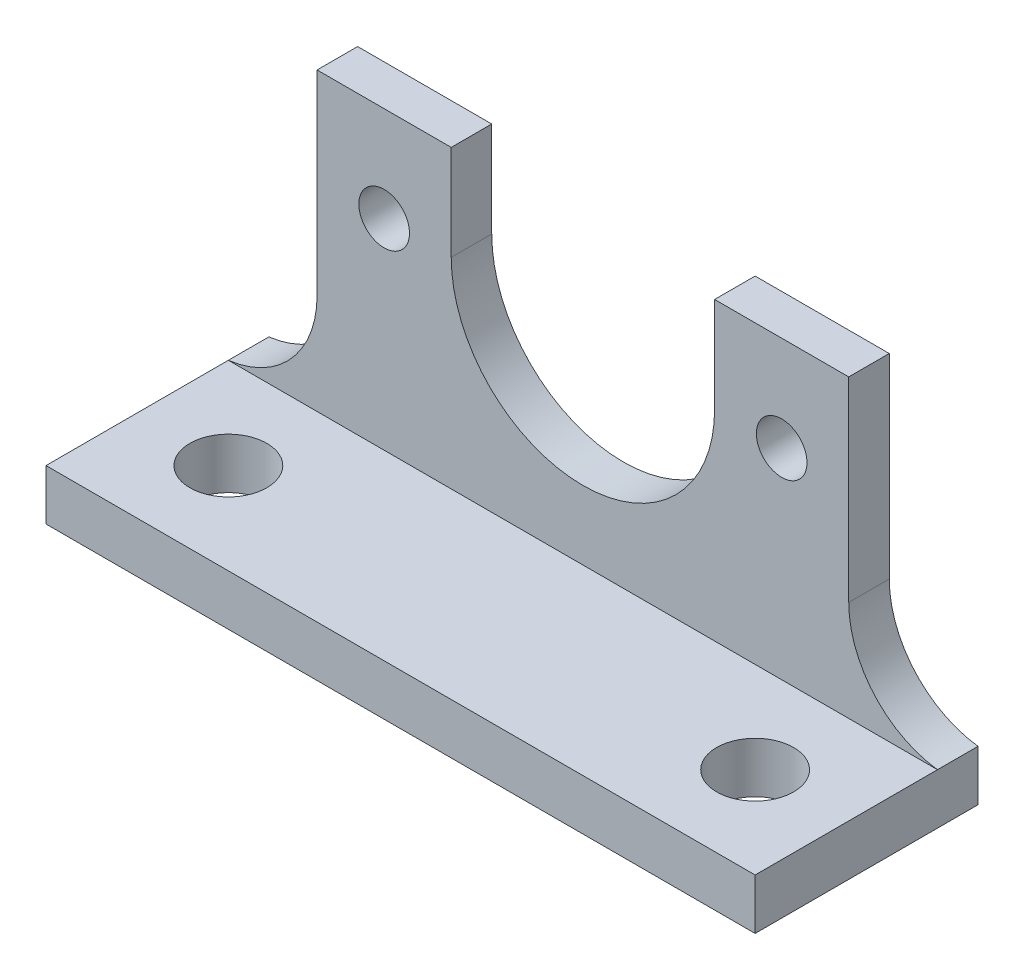
ISO-10303-21;
HEADER;
FILE_DESCRIPTION(('STEP AP214'),'2;1');
FILE_NAME('part.step','',(''),(''),'','','');
FILE_SCHEMA(('AUTOMOTIVE_DESIGN { 1 0 10303 214 1 1 1 1 }'));
ENDSEC;
DATA;
#1=APPLICATION_CONTEXT('core data for automotive mechanical design processes');
#2=APPLICATION_PROTOCOL_DEFINITION('international standard','automotive_design',2000,#1);
#3=PRODUCT_CONTEXT('',#1,'mechanical');
#4=PRODUCT('Part','Part','',(#3));
#5=PRODUCT_RELATED_PRODUCT_CATEGORY('part','',(#4));
#6=PRODUCT_DEFINITION_FORMATION('','',#4);
#7=PRODUCT_DEFINITION_CONTEXT('part definition',#1,'design');
#8=PRODUCT_DEFINITION('design','',#6,#7);
#9=PRODUCT_DEFINITION_SHAPE('','',#8);
#10=(LENGTH_UNIT() NAMED_UNIT(*) SI_UNIT(.MILLI.,.METRE.));
#11=(NAMED_UNIT(*) PLANE_ANGLE_UNIT() SI_UNIT($,.RADIAN.));
#12=(NAMED_UNIT(*) SI_UNIT($,.STERADIAN.) SOLID_ANGLE_UNIT());
#13=UNCERTAINTY_MEASURE_WITH_UNIT(LENGTH_MEASURE(1.E-05),#10,'distance_accuracy_value','');
#14=(GEOMETRIC_REPRESENTATION_CONTEXT(3) GLOBAL_UNCERTAINTY_ASSIGNED_CONTEXT((#13)) GLOBAL_UNIT_ASSIGNED_CONTEXT((#10,
#11,#12)) REPRESENTATION_CONTEXT('',''));
#15=CARTESIAN_POINT('',(0.,0.,0.));
#16=DIRECTION('',(0.,0.,1.));
#17=DIRECTION('',(1.,0.,0.));
#18=AXIS2_PLACEMENT_3D('',#15,#16,#17);
#19=CARTESIAN_POINT('',(0.,-5.23076923076924,2.54));
#20=DIRECTION('',(0.,0.,1.));
#21=DIRECTION('',(1.,0.,0.));
#22=AXIS2_PLACEMENT_3D('',#19,#20,#21);
#23=PLANE('',#22);
#24=DIRECTION('',(-1.,0.,0.));
#25=VECTOR('',#24,1.);
#26=CARTESIAN_POINT('',(0.,-17.8037692307692,2.54));
#27=LINE('',#26,#25);
#28=CARTESIAN_POINT('',(22.225,-17.8037692307692,2.54));
#29=VERTEX_POINT('',#28);
#30=CARTESIAN_POINT('',(-22.225,-17.8037692307692,2.54));
#31=VERTEX_POINT('',#30);
#32=EDGE_CURVE('E262',#29,#31,#27,.T.);
#33=ORIENTED_EDGE('',*,*,#32,.F.);
#34=CARTESIAN_POINT('',(23.0124,-11.502777146978,2.54));
#35=DIRECTION('',(0.,0.,1.));
#36=DIRECTION('',(1.,0.,0.));
#37=AXIS2_PLACEMENT_3D('',#34,#35,#36);
#38=CIRCLE('',#37,6.35);
#39=CARTESIAN_POINT('',(16.6624,-11.502777146978,2.54));
#40=VERTEX_POINT('',#39);
#41=EDGE_CURVE('E12',#29,#40,#38,.F.);
#42=ORIENTED_EDGE('',*,*,#41,.T.);
#43=DIRECTION('',(0.,1.,0.));
#44=VECTOR('',#43,1.);
#45=CARTESIAN_POINT('',(16.6624,-5.23076923076924,2.54));
#46=LINE('',#45,#44);
#47=CARTESIAN_POINT('',(16.6624,0.738461538461539,2.54));
#48=VERTEX_POINT('',#47);
#49=EDGE_CURVE('E241',#40,#48,#46,.T.);
#50=ORIENTED_EDGE('',*,*,#49,.T.);
#51=DIRECTION('',(-1.,0.,0.));
#52=VECTOR('',#51,1.);
#53=CARTESIAN_POINT('',(8.255,0.738461538461539,2.54));
#54=LINE('',#53,#52);
#55=CARTESIAN_POINT('',(8.255,0.738461538461539,2.54));
#56=VERTEX_POINT('',#55);
#57=EDGE_CURVE('E239',#48,#56,#54,.T.);
#58=ORIENTED_EDGE('',*,*,#57,.T.);
#59=DIRECTION('',(0.,-1.,0.));
#60=VECTOR('',#59,1.);
#61=CARTESIAN_POINT('',(8.255,-5.23076923076924,2.54));
#62=LINE('',#61,#60);
#63=CARTESIAN_POINT('',(8.255,-5.23076923076924,2.54));
#64=VERTEX_POINT('',#63);
#65=EDGE_CURVE('E216',#56,#64,#62,.T.);
#66=ORIENTED_EDGE('',*,*,#65,.T.);
#67=CARTESIAN_POINT('',(0.,-5.23076923076924,2.54));
#68=DIRECTION('',(0.,0.,-1.));
#69=DIRECTION('',(1.,0.,0.));
#70=AXIS2_PLACEMENT_3D('',#67,#68,#69);
#71=CIRCLE('',#70,8.255);
#72=CARTESIAN_POINT('',(-8.255,-5.23076923076924,2.54));
#73=VERTEX_POINT('',#72);
#74=EDGE_CURVE('E219',#64,#73,#71,.T.);
#75=ORIENTED_EDGE('',*,*,#74,.T.);
#76=DIRECTION('',(0.,1.,0.));
#77=VECTOR('',#76,1.);
#78=CARTESIAN_POINT('',(-8.255,-5.23076923076924,2.54));
#79=LINE('',#78,#77);
#80=CARTESIAN_POINT('',(-8.255,0.738461538461539,2.54));
#81=VERTEX_POINT('',#80);
#82=EDGE_CURVE('E249',#73,#81,#79,.T.);
#83=ORIENTED_EDGE('',*,*,#82,.T.);
#84=DIRECTION('',(-1.,0.,0.));
#85=VECTOR('',#84,1.);
#86=CARTESIAN_POINT('',(-8.255,0.738461538461539,2.54));
#87=LINE('',#86,#85);
#88=CARTESIAN_POINT('',(-16.6624,0.738461538461539,2.54));
#89=VERTEX_POINT('',#88);
#90=EDGE_CURVE('E247',#81,#89,#87,.T.);
#91=ORIENTED_EDGE('',*,*,#90,.T.);
#92=DIRECTION('',(0.,-1.,0.));
#93=VECTOR('',#92,1.);
#94=CARTESIAN_POINT('',(-16.6624,-5.23076923076924,2.54));
#95=LINE('',#94,#93);
#96=CARTESIAN_POINT('',(-16.6624,-11.502777146978,2.54));
#97=VERTEX_POINT('',#96);
#98=EDGE_CURVE('E243',#89,#97,#95,.T.);
#99=ORIENTED_EDGE('',*,*,#98,.T.);
#100=CARTESIAN_POINT('',(-23.0124,-11.502777146978,2.54));
#101=DIRECTION('',(0.,0.,1.));
#102=DIRECTION('',(1.,0.,0.));
#103=AXIS2_PLACEMENT_3D('',#100,#101,#102);
#104=CIRCLE('',#103,6.35);
#105=EDGE_CURVE('E189',#97,#31,#104,.F.);
#106=ORIENTED_EDGE('',*,*,#105,.T.);
#107=EDGE_LOOP('',(#33,#42,#50,#58,#66,#75,#83,#91,#99,#106));
#108=FACE_BOUND('',#107,.T.);
#109=CARTESIAN_POINT('',(-12.4587,-5.23076923076924,2.54));
#110=DIRECTION('',(0.,0.,1.));
#111=DIRECTION('',(1.,0.,0.));
#112=AXIS2_PLACEMENT_3D('',#109,#110,#111);
#113=CIRCLE('',#112,1.5875);
#114=CARTESIAN_POINT('',(-10.8712,-5.23076923076924,2.54));
#115=VERTEX_POINT('',#114);
#116=EDGE_CURVE('E237',#115,#115,#113,.T.);
#117=ORIENTED_EDGE('',*,*,#116,.F.);
#118=EDGE_LOOP('',(#117));
#119=FACE_BOUND('',#118,.T.);
#120=CARTESIAN_POINT('',(12.4587,-5.23076923076924,2.54));
#121=DIRECTION('',(0.,0.,1.));
#122=DIRECTION('',(-1.,0.,0.));
#123=AXIS2_PLACEMENT_3D('',#120,#121,#122);
#124=CIRCLE('',#123,1.5875);
#125=CARTESIAN_POINT('',(10.8712,-5.23076923076924,2.54));
#126=VERTEX_POINT('',#125);
#127=EDGE_CURVE('E256',#126,#126,#124,.T.);
#128=ORIENTED_EDGE('',*,*,#127,.F.);
#129=EDGE_LOOP('',(#128));
#130=FACE_BOUND('',#129,.T.);
#131=ADVANCED_FACE('F46',(#108,#119,#130),#23,.T.);
#132=CARTESIAN_POINT('',(0.,-5.23076923076924,0.));
#133=DIRECTION('',(0.,0.,1.));
#134=DIRECTION('',(1.,0.,0.));
#135=AXIS2_PLACEMENT_3D('',#132,#133,#134);
#136=PLANE('',#135);
#137=CARTESIAN_POINT('',(-12.4587,-5.23076923076924,0.));
#138=DIRECTION('',(0.,0.,1.));
#139=DIRECTION('',(1.,0.,0.));
#140=AXIS2_PLACEMENT_3D('',#137,#138,#139);
#141=CIRCLE('',#140,1.5875);
#142=CARTESIAN_POINT('',(-10.8712,-5.23076923076924,0.));
#143=VERTEX_POINT('',#142);
#144=EDGE_CURVE('E253',#143,#143,#141,.T.);
#145=ORIENTED_EDGE('',*,*,#144,.T.);
#146=EDGE_LOOP('',(#145));
#147=FACE_BOUND('',#146,.T.);
#148=DIRECTION('',(0.,1.,0.));
#149=VECTOR('',#148,1.);
#150=CARTESIAN_POINT('',(16.6624,-5.23076923076924,0.));
#151=LINE('',#150,#149);
#152=CARTESIAN_POINT('',(16.6624,-11.502777146978,0.));
#153=VERTEX_POINT('',#152);
#154=CARTESIAN_POINT('',(16.6624,0.738461538461539,0.));
#155=VERTEX_POINT('',#154);
#156=EDGE_CURVE('E222',#153,#155,#151,.T.);
#157=ORIENTED_EDGE('',*,*,#156,.F.);
#158=CARTESIAN_POINT('',(23.0124,-11.502777146978,0.));
#159=DIRECTION('',(0.,0.,1.));
#160=DIRECTION('',(1.,0.,0.));
#161=AXIS2_PLACEMENT_3D('',#158,#159,#160);
#162=CIRCLE('',#161,6.35);
#163=CARTESIAN_POINT('',(22.225,-17.8037692307692,0.));
#164=VERTEX_POINT('',#163);
#165=EDGE_CURVE('E54',#153,#164,#162,.T.);
#166=ORIENTED_EDGE('',*,*,#165,.T.);
#167=DIRECTION('',(0.,1.,0.));
#168=VECTOR('',#167,1.);
#169=CARTESIAN_POINT('',(22.225,-20.9787692307692,0.));
#170=LINE('',#169,#168);
#171=CARTESIAN_POINT('',(22.225,-20.9787692307692,0.));
#172=VERTEX_POINT('',#171);
#173=EDGE_CURVE('E150',#172,#164,#170,.T.);
#174=ORIENTED_EDGE('',*,*,#173,.F.);
#175=DIRECTION('',(1.,0.,0.));
#176=VECTOR('',#175,1.);
#177=CARTESIAN_POINT('',(-16.6624,-20.9787692307692,0.));
#178=LINE('',#177,#176);
#179=CARTESIAN_POINT('',(-22.225,-20.9787692307692,0.));
#180=VERTEX_POINT('',#179);
#181=EDGE_CURVE('E224',#180,#172,#178,.T.);
#182=ORIENTED_EDGE('',*,*,#181,.F.);
#183=DIRECTION('',(0.,-1.,0.));
#184=VECTOR('',#183,1.);
#185=CARTESIAN_POINT('',(-22.225,-20.9787692307692,0.));
#186=LINE('',#185,#184);
#187=CARTESIAN_POINT('',(-22.225,-17.8037692307692,0.));
#188=VERTEX_POINT('',#187);
#189=EDGE_CURVE('E147',#188,#180,#186,.T.);
#190=ORIENTED_EDGE('',*,*,#189,.F.);
#191=CARTESIAN_POINT('',(-23.0124,-11.502777146978,0.));
#192=DIRECTION('',(0.,0.,1.));
#193=DIRECTION('',(1.,0.,0.));
#194=AXIS2_PLACEMENT_3D('',#191,#192,#193);
#195=CIRCLE('',#194,6.35);
#196=CARTESIAN_POINT('',(-16.6624,-11.502777146978,0.));
#197=VERTEX_POINT('',#196);
#198=EDGE_CURVE('E187',#188,#197,#195,.T.);
#199=ORIENTED_EDGE('',*,*,#198,.T.);
#200=DIRECTION('',(0.,-1.,0.));
#201=VECTOR('',#200,1.);
#202=CARTESIAN_POINT('',(-16.6624,-5.23076923076924,0.));
#203=LINE('',#202,#201);
#204=CARTESIAN_POINT('',(-16.6624,0.738461538461539,0.));
#205=VERTEX_POINT('',#204);
#206=EDGE_CURVE('E226',#205,#197,#203,.T.);
#207=ORIENTED_EDGE('',*,*,#206,.F.);
#208=DIRECTION('',(-1.,0.,0.));
#209=VECTOR('',#208,1.);
#210=CARTESIAN_POINT('',(-8.255,0.738461538461539,0.));
#211=LINE('',#210,#209);
#212=CARTESIAN_POINT('',(-8.255,0.738461538461539,0.));
#213=VERTEX_POINT('',#212);
#214=EDGE_CURVE('E229',#213,#205,#211,.T.);
#215=ORIENTED_EDGE('',*,*,#214,.F.);
#216=DIRECTION('',(0.,1.,0.));
#217=VECTOR('',#216,1.);
#218=CARTESIAN_POINT('',(-8.255,-5.23076923076924,0.));
#219=LINE('',#218,#217);
#220=CARTESIAN_POINT('',(-8.255,-5.23076923076924,0.));
#221=VERTEX_POINT('',#220);
#222=EDGE_CURVE('E232',#221,#213,#219,.T.);
#223=ORIENTED_EDGE('',*,*,#222,.F.);
#224=CARTESIAN_POINT('',(0.,-5.23076923076924,0.));
#225=DIRECTION('',(0.,0.,-1.));
#226=DIRECTION('',(1.,0.,0.));
#227=AXIS2_PLACEMENT_3D('',#224,#225,#226);
#228=CIRCLE('',#227,8.255);
#229=CARTESIAN_POINT('',(8.255,-5.23076923076924,0.));
#230=VERTEX_POINT('',#229);
#231=EDGE_CURVE('E234',#230,#221,#228,.T.);
#232=ORIENTED_EDGE('',*,*,#231,.F.);
#233=DIRECTION('',(0.,-1.,0.));
#234=VECTOR('',#233,1.);
#235=CARTESIAN_POINT('',(8.255,-5.23076923076924,0.));
#236=LINE('',#235,#234);
#237=CARTESIAN_POINT('',(8.255,0.738461538461539,0.));
#238=VERTEX_POINT('',#237);
#239=EDGE_CURVE('E217',#238,#230,#236,.T.);
#240=ORIENTED_EDGE('',*,*,#239,.F.);
#241=DIRECTION('',(-1.,0.,0.));
#242=VECTOR('',#241,1.);
#243=CARTESIAN_POINT('',(8.255,0.738461538461539,0.));
#244=LINE('',#243,#242);
#245=EDGE_CURVE('E220',#155,#238,#244,.T.);
#246=ORIENTED_EDGE('',*,*,#245,.F.);
#247=EDGE_LOOP('',(#157,#166,#174,#182,#190,#199,#207,#215,#223,#232,#240,#246));
#248=FACE_BOUND('',#247,.T.);
#249=CARTESIAN_POINT('',(12.4587,-5.23076923076924,0.));
#250=DIRECTION('',(0.,0.,1.));
#251=DIRECTION('',(-1.,0.,0.));
#252=AXIS2_PLACEMENT_3D('',#249,#250,#251);
#253=CIRCLE('',#252,1.5875);
#254=CARTESIAN_POINT('',(10.8712,-5.23076923076924,0.));
#255=VERTEX_POINT('',#254);
#256=EDGE_CURVE('E259',#255,#255,#253,.T.);
#257=ORIENTED_EDGE('',*,*,#256,.T.);
#258=EDGE_LOOP('',(#257));
#259=FACE_BOUND('',#258,.T.);
#260=ADVANCED_FACE('F313',(#147,#248,#259),#136,.F.);
#261=CARTESIAN_POINT('',(0.,-5.23076923076924,2.54));
#262=DIRECTION('',(0.,0.,-1.));
#263=DIRECTION('',(-1.,0.,0.));
#264=AXIS2_PLACEMENT_3D('',#261,#262,#263);
#265=CYLINDRICAL_SURFACE('',#264,8.255);
#266=ORIENTED_EDGE('',*,*,#231,.T.);
#267=DIRECTION('',(0.,0.,-1.));
#268=VECTOR('',#267,1.);
#269=CARTESIAN_POINT('',(-8.255,-5.23076923076924,2.54));
#270=LINE('',#269,#268);
#271=EDGE_CURVE('E198',#73,#221,#270,.T.);
#272=ORIENTED_EDGE('',*,*,#271,.F.);
#273=ORIENTED_EDGE('',*,*,#74,.F.);
#274=DIRECTION('',(0.,0.,-1.));
#275=VECTOR('',#274,1.);
#276=CARTESIAN_POINT('',(8.255,-5.23076923076924,2.54));
#277=LINE('',#276,#275);
#278=EDGE_CURVE('E213',#64,#230,#277,.T.);
#279=ORIENTED_EDGE('',*,*,#278,.T.);
#280=EDGE_LOOP('',(#266,#272,#273,#279));
#281=FACE_BOUND('',#280,.T.);
#282=ADVANCED_FACE('F330',(#281),#265,.F.);
#283=CARTESIAN_POINT('',(-8.255,-5.23076923076924,2.54));
#284=DIRECTION('',(-1.,0.,0.));
#285=DIRECTION('',(0.,0.,1.));
#286=AXIS2_PLACEMENT_3D('',#283,#284,#285);
#287=PLANE('',#286);
#288=ORIENTED_EDGE('',*,*,#222,.T.);
#289=DIRECTION('',(0.,0.,-1.));
#290=VECTOR('',#289,1.);
#291=CARTESIAN_POINT('',(-8.255,0.738461538461539,2.54));
#292=LINE('',#291,#290);
#293=EDGE_CURVE('E201',#81,#213,#292,.T.);
#294=ORIENTED_EDGE('',*,*,#293,.F.);
#295=ORIENTED_EDGE('',*,*,#82,.F.);
#296=ORIENTED_EDGE('',*,*,#271,.T.);
#297=EDGE_LOOP('',(#288,#294,#295,#296));
#298=FACE_BOUND('',#297,.T.);
#299=ADVANCED_FACE('F327',(#298),#287,.F.);
#300=CARTESIAN_POINT('',(-8.255,0.738461538461539,2.54));
#301=DIRECTION('',(0.,-1.,0.));
#302=DIRECTION('',(0.,0.,-1.));
#303=AXIS2_PLACEMENT_3D('',#300,#301,#302);
#304=PLANE('',#303);
#305=ORIENTED_EDGE('',*,*,#214,.T.);
#306=DIRECTION('',(0.,0.,-1.));
#307=VECTOR('',#306,1.);
#308=CARTESIAN_POINT('',(-16.6624,0.738461538461539,2.54));
#309=LINE('',#308,#307);
#310=EDGE_CURVE('E204',#89,#205,#309,.T.);
#311=ORIENTED_EDGE('',*,*,#310,.F.);
#312=ORIENTED_EDGE('',*,*,#90,.F.);
#313=ORIENTED_EDGE('',*,*,#293,.T.);
#314=EDGE_LOOP('',(#305,#311,#312,#313));
#315=FACE_BOUND('',#314,.T.);
#316=ADVANCED_FACE('F321',(#315),#304,.F.);
#317=CARTESIAN_POINT('',(-16.6624,-5.23076923076924,2.54));
#318=DIRECTION('',(1.,0.,0.));
#319=DIRECTION('',(0.,1.,0.));
#320=AXIS2_PLACEMENT_3D('',#317,#318,#319);
#321=PLANE('',#320);
#322=ORIENTED_EDGE('',*,*,#206,.T.);
#323=DIRECTION('',(0.,0.,1.));
#324=VECTOR('',#323,1.);
#325=CARTESIAN_POINT('',(-16.6624,-11.502777146978,2.54));
#326=LINE('',#325,#324);
#327=EDGE_CURVE('E195',#197,#97,#326,.T.);
#328=ORIENTED_EDGE('',*,*,#327,.T.);
#329=ORIENTED_EDGE('',*,*,#98,.F.);
#330=ORIENTED_EDGE('',*,*,#310,.T.);
#331=EDGE_LOOP('',(#322,#328,#329,#330));
#332=FACE_BOUND('',#331,.T.);
#333=ADVANCED_FACE('F317',(#332),#321,.F.);
#334=CARTESIAN_POINT('',(-16.6624,-20.9787692307692,2.54));
#335=DIRECTION('',(0.,1.,0.));
#336=DIRECTION('',(0.,0.,1.));
#337=AXIS2_PLACEMENT_3D('',#334,#335,#336);
#338=PLANE('',#337);
#339=CARTESIAN_POINT('',(16.51,-20.9787692307692,8.255));
#340=DIRECTION('',(0.,1.,0.));
#341=DIRECTION('',(0.,0.,-1.));
#342=AXIS2_PLACEMENT_3D('',#339,#340,#341);
#343=CIRCLE('',#342,2.413);
#344=CARTESIAN_POINT('',(16.51,-20.9787692307692,5.842));
#345=VERTEX_POINT('',#344);
#346=EDGE_CURVE('E287',#345,#345,#343,.T.);
#347=ORIENTED_EDGE('',*,*,#346,.T.);
#348=EDGE_LOOP('',(#347));
#349=FACE_BOUND('',#348,.T.);
#350=CARTESIAN_POINT('',(-16.51,-20.9787692307692,8.255));
#351=DIRECTION('',(0.,1.,0.));
#352=DIRECTION('',(0.,0.,1.));
#353=AXIS2_PLACEMENT_3D('',#350,#351,#352);
#354=CIRCLE('',#353,2.413);
#355=CARTESIAN_POINT('',(-16.51,-20.9787692307692,10.668));
#356=VERTEX_POINT('',#355);
#357=EDGE_CURVE('E167',#356,#356,#354,.T.);
#358=ORIENTED_EDGE('',*,*,#357,.T.);
#359=EDGE_LOOP('',(#358));
#360=FACE_BOUND('',#359,.T.);
#361=DIRECTION('',(0.,0.,1.));
#362=VECTOR('',#361,1.);
#363=CARTESIAN_POINT('',(-22.225,-20.9787692307692,0.));
#364=LINE('',#363,#362);
#365=CARTESIAN_POINT('',(-22.225,-20.9787692307692,13.97));
#366=VERTEX_POINT('',#365);
#367=EDGE_CURVE('E140',#180,#366,#364,.T.);
#368=ORIENTED_EDGE('',*,*,#367,.F.);
#369=ORIENTED_EDGE('',*,*,#181,.T.);
#370=DIRECTION('',(0.,0.,1.));
#371=VECTOR('',#370,1.);
#372=CARTESIAN_POINT('',(22.225,-20.9787692307692,0.));
#373=LINE('',#372,#371);
#374=CARTESIAN_POINT('',(22.225,-20.9787692307692,13.97));
#375=VERTEX_POINT('',#374);
#376=EDGE_CURVE('E149',#172,#375,#373,.T.);
#377=ORIENTED_EDGE('',*,*,#376,.T.);
#378=DIRECTION('',(1.,0.,0.));
#379=VECTOR('',#378,1.);
#380=CARTESIAN_POINT('',(-22.225,-20.9787692307692,13.97));
#381=LINE('',#380,#379);
#382=EDGE_CURVE('E153',#366,#375,#381,.T.);
#383=ORIENTED_EDGE('',*,*,#382,.F.);
#384=EDGE_LOOP('',(#368,#369,#377,#383));
#385=FACE_BOUND('',#384,.T.);
#386=ADVANCED_FACE('F154',(#349,#360,#385),#338,.F.);
#387=CARTESIAN_POINT('',(16.6624,-5.23076923076924,2.54));
#388=DIRECTION('',(-1.,0.,0.));
#389=DIRECTION('',(0.,0.,1.));
#390=AXIS2_PLACEMENT_3D('',#387,#388,#389);
#391=PLANE('',#390);
#392=ORIENTED_EDGE('',*,*,#49,.F.);
#393=DIRECTION('',(0.,0.,-1.));
#394=VECTOR('',#393,1.);
#395=CARTESIAN_POINT('',(16.6624,-11.502777146978,2.54));
#396=LINE('',#395,#394);
#397=EDGE_CURVE('E193',#40,#153,#396,.T.);
#398=ORIENTED_EDGE('',*,*,#397,.T.);
#399=ORIENTED_EDGE('',*,*,#156,.T.);
#400=DIRECTION('',(0.,0.,-1.));
#401=VECTOR('',#400,1.);
#402=CARTESIAN_POINT('',(16.6624,0.738461538461539,2.54));
#403=LINE('',#402,#401);
#404=EDGE_CURVE('E207',#48,#155,#403,.T.);
#405=ORIENTED_EDGE('',*,*,#404,.F.);
#406=EDGE_LOOP('',(#392,#398,#399,#405));
#407=FACE_BOUND('',#406,.T.);
#408=ADVANCED_FACE('F342',(#407),#391,.F.);
#409=CARTESIAN_POINT('',(8.255,0.738461538461539,2.54));
#410=DIRECTION('',(0.,-1.,0.));
#411=DIRECTION('',(0.,0.,-1.));
#412=AXIS2_PLACEMENT_3D('',#409,#410,#411);
#413=PLANE('',#412);
#414=ORIENTED_EDGE('',*,*,#245,.T.);
#415=DIRECTION('',(0.,0.,-1.));
#416=VECTOR('',#415,1.);
#417=CARTESIAN_POINT('',(8.255,0.738461538461539,2.54));
#418=LINE('',#417,#416);
#419=EDGE_CURVE('E210',#56,#238,#418,.T.);
#420=ORIENTED_EDGE('',*,*,#419,.F.);
#421=ORIENTED_EDGE('',*,*,#57,.F.);
#422=ORIENTED_EDGE('',*,*,#404,.T.);
#423=EDGE_LOOP('',(#414,#420,#421,#422));
#424=FACE_BOUND('',#423,.T.);
#425=ADVANCED_FACE('F338',(#424),#413,.F.);
#426=CARTESIAN_POINT('',(8.255,-5.23076923076924,2.54));
#427=DIRECTION('',(1.,0.,0.));
#428=DIRECTION('',(0.,0.,-1.));
#429=AXIS2_PLACEMENT_3D('',#426,#427,#428);
#430=PLANE('',#429);
#431=ORIENTED_EDGE('',*,*,#239,.T.);
#432=ORIENTED_EDGE('',*,*,#278,.F.);
#433=ORIENTED_EDGE('',*,*,#65,.F.);
#434=ORIENTED_EDGE('',*,*,#419,.T.);
#435=EDGE_LOOP('',(#431,#432,#433,#434));
#436=FACE_BOUND('',#435,.T.);
#437=ADVANCED_FACE('F334',(#436),#430,.F.);
#438=CARTESIAN_POINT('',(-12.4587,-5.23076923076924,2.54));
#439=DIRECTION('',(0.,0.,-1.));
#440=DIRECTION('',(-1.,0.,0.));
#441=AXIS2_PLACEMENT_3D('',#438,#439,#440);
#442=CYLINDRICAL_SURFACE('',#441,1.5875);
#443=ORIENTED_EDGE('',*,*,#116,.T.);
#444=EDGE_LOOP('',(#443));
#445=FACE_BOUND('',#444,.T.);
#446=ORIENTED_EDGE('',*,*,#144,.F.);
#447=EDGE_LOOP('',(#446));
#448=FACE_BOUND('',#447,.T.);
#449=ADVANCED_FACE('F363',(#445,#448),#442,.F.);
#450=CARTESIAN_POINT('',(12.4587,-5.23076923076924,2.54));
#451=DIRECTION('',(0.,0.,-1.));
#452=DIRECTION('',(-1.,0.,0.));
#453=AXIS2_PLACEMENT_3D('',#450,#451,#452);
#454=CYLINDRICAL_SURFACE('',#453,1.5875);
#455=ORIENTED_EDGE('',*,*,#127,.T.);
#456=EDGE_LOOP('',(#455));
#457=FACE_BOUND('',#456,.T.);
#458=ORIENTED_EDGE('',*,*,#256,.F.);
#459=EDGE_LOOP('',(#458));
#460=FACE_BOUND('',#459,.T.);
#461=ADVANCED_FACE('F301',(#457,#460),#454,.F.);
#462=CARTESIAN_POINT('',(-22.225,-17.8037692307692,0.));
#463=DIRECTION('',(0.,1.,0.));
#464=DIRECTION('',(0.,0.,1.));
#465=AXIS2_PLACEMENT_3D('',#462,#463,#464);
#466=PLANE('',#465);
#467=CARTESIAN_POINT('',(16.51,-17.8037692307692,8.255));
#468=DIRECTION('',(0.,1.,0.));
#469=DIRECTION('',(0.,0.,-1.));
#470=AXIS2_PLACEMENT_3D('',#467,#468,#469);
#471=CIRCLE('',#470,2.413);
#472=CARTESIAN_POINT('',(16.51,-17.8037692307692,5.842));
#473=VERTEX_POINT('',#472);
#474=EDGE_CURVE('E283',#473,#473,#471,.T.);
#475=ORIENTED_EDGE('',*,*,#474,.F.);
#476=EDGE_LOOP('',(#475));
#477=FACE_BOUND('',#476,.T.);
#478=CARTESIAN_POINT('',(-16.51,-17.8037692307692,8.255));
#479=DIRECTION('',(0.,1.,0.));
#480=DIRECTION('',(0.,0.,1.));
#481=AXIS2_PLACEMENT_3D('',#478,#479,#480);
#482=CIRCLE('',#481,2.413);
#483=CARTESIAN_POINT('',(-16.51,-17.8037692307692,10.668));
#484=VERTEX_POINT('',#483);
#485=EDGE_CURVE('E173',#484,#484,#482,.T.);
#486=ORIENTED_EDGE('',*,*,#485,.F.);
#487=EDGE_LOOP('',(#486));
#488=FACE_BOUND('',#487,.T.);
#489=ORIENTED_EDGE('',*,*,#32,.T.);
#490=DIRECTION('',(0.,0.,1.));
#491=VECTOR('',#490,1.);
#492=CARTESIAN_POINT('',(-22.225,-17.8037692307692,0.));
#493=LINE('',#492,#491);
#494=CARTESIAN_POINT('',(-22.225,-17.8037692307692,13.97));
#495=VERTEX_POINT('',#494);
#496=EDGE_CURVE('E272',#31,#495,#493,.T.);
#497=ORIENTED_EDGE('',*,*,#496,.T.);
#498=DIRECTION('',(-1.,0.,0.));
#499=VECTOR('',#498,1.);
#500=CARTESIAN_POINT('',(-22.225,-17.8037692307692,13.97));
#501=LINE('',#500,#499);
#502=CARTESIAN_POINT('',(22.225,-17.8037692307692,13.97));
#503=VERTEX_POINT('',#502);
#504=EDGE_CURVE('E165',#503,#495,#501,.T.);
#505=ORIENTED_EDGE('',*,*,#504,.F.);
#506=DIRECTION('',(0.,0.,1.));
#507=VECTOR('',#506,1.);
#508=CARTESIAN_POINT('',(22.225,-17.8037692307692,0.));
#509=LINE('',#508,#507);
#510=EDGE_CURVE('E267',#29,#503,#509,.T.);
#511=ORIENTED_EDGE('',*,*,#510,.F.);
#512=EDGE_LOOP('',(#489,#497,#505,#511));
#513=FACE_BOUND('',#512,.T.);
#514=ADVANCED_FACE('F298',(#477,#488,#513),#466,.T.);
#515=CARTESIAN_POINT('',(-22.225,-20.9787692307692,0.));
#516=DIRECTION('',(-1.,0.,0.));
#517=DIRECTION('',(0.,0.,1.));
#518=AXIS2_PLACEMENT_3D('',#515,#516,#517);
#519=PLANE('',#518);
#520=ORIENTED_EDGE('',*,*,#367,.T.);
#521=DIRECTION('',(0.,-1.,0.));
#522=VECTOR('',#521,1.);
#523=CARTESIAN_POINT('',(-22.225,-20.9787692307692,13.97));
#524=LINE('',#523,#522);
#525=EDGE_CURVE('E145',#495,#366,#524,.T.);
#526=ORIENTED_EDGE('',*,*,#525,.F.);
#527=ORIENTED_EDGE('',*,*,#496,.F.);
#528=EDGE_CURVE('E265',#188,#31,#493,.T.);
#529=ORIENTED_EDGE('',*,*,#528,.F.);
#530=ORIENTED_EDGE('',*,*,#189,.T.);
#531=EDGE_LOOP('',(#520,#526,#527,#529,#530));
#532=FACE_BOUND('',#531,.T.);
#533=ADVANCED_FACE('F142',(#532),#519,.T.);
#534=CARTESIAN_POINT('',(22.225,-20.9787692307692,0.));
#535=DIRECTION('',(1.,0.,0.));
#536=DIRECTION('',(0.,0.,-1.));
#537=AXIS2_PLACEMENT_3D('',#534,#535,#536);
#538=PLANE('',#537);
#539=EDGE_CURVE('E268',#164,#29,#509,.T.);
#540=ORIENTED_EDGE('',*,*,#539,.T.);
#541=ORIENTED_EDGE('',*,*,#510,.T.);
#542=DIRECTION('',(0.,1.,0.));
#543=VECTOR('',#542,1.);
#544=CARTESIAN_POINT('',(22.225,-20.9787692307692,13.97));
#545=LINE('',#544,#543);
#546=EDGE_CURVE('E160',#375,#503,#545,.T.);
#547=ORIENTED_EDGE('',*,*,#546,.F.);
#548=ORIENTED_EDGE('',*,*,#376,.F.);
#549=ORIENTED_EDGE('',*,*,#173,.T.);
#550=EDGE_LOOP('',(#540,#541,#547,#548,#549));
#551=FACE_BOUND('',#550,.T.);
#552=ADVANCED_FACE('F344',(#551),#538,.T.);
#553=CARTESIAN_POINT('',(0.,0.,13.97));
#554=DIRECTION('',(0.,0.,-1.));
#555=DIRECTION('',(-1.,0.,0.));
#556=AXIS2_PLACEMENT_3D('',#553,#554,#555);
#557=PLANE('',#556);
#558=ORIENTED_EDGE('',*,*,#525,.T.);
#559=ORIENTED_EDGE('',*,*,#382,.T.);
#560=ORIENTED_EDGE('',*,*,#546,.T.);
#561=ORIENTED_EDGE('',*,*,#504,.T.);
#562=EDGE_LOOP('',(#558,#559,#560,#561));
#563=FACE_BOUND('',#562,.T.);
#564=ADVANCED_FACE('F163',(#563),#557,.F.);
#565=CARTESIAN_POINT('',(-16.51,-20.9787692307692,8.255));
#566=DIRECTION('',(0.,1.,0.));
#567=DIRECTION('',(0.,0.,1.));
#568=AXIS2_PLACEMENT_3D('',#565,#566,#567);
#569=CYLINDRICAL_SURFACE('',#568,2.413);
#570=ORIENTED_EDGE('',*,*,#357,.F.);
#571=EDGE_LOOP('',(#570));
#572=FACE_BOUND('',#571,.T.);
#573=ORIENTED_EDGE('',*,*,#485,.T.);
#574=EDGE_LOOP('',(#573));
#575=FACE_BOUND('',#574,.T.);
#576=ADVANCED_FACE('F296',(#572,#575),#569,.F.);
#577=CARTESIAN_POINT('',(16.51,-20.9787692307692,8.255));
#578=DIRECTION('',(0.,1.,0.));
#579=DIRECTION('',(0.,0.,1.));
#580=AXIS2_PLACEMENT_3D('',#577,#578,#579);
#581=CYLINDRICAL_SURFACE('',#580,2.413);
#582=ORIENTED_EDGE('',*,*,#346,.F.);
#583=EDGE_LOOP('',(#582));
#584=FACE_BOUND('',#583,.T.);
#585=ORIENTED_EDGE('',*,*,#474,.T.);
#586=EDGE_LOOP('',(#585));
#587=FACE_BOUND('',#586,.T.);
#588=ADVANCED_FACE('F382',(#584,#587),#581,.F.);
#589=CARTESIAN_POINT('',(-23.0124,-11.502777146978,0.));
#590=DIRECTION('',(0.,0.,1.));
#591=DIRECTION('',(1.,0.,0.));
#592=AXIS2_PLACEMENT_3D('',#589,#590,#591);
#593=CYLINDRICAL_SURFACE('',#592,6.35);
#594=ORIENTED_EDGE('',*,*,#198,.F.);
#595=ORIENTED_EDGE('',*,*,#528,.T.);
#596=ORIENTED_EDGE('',*,*,#105,.F.);
#597=ORIENTED_EDGE('',*,*,#327,.F.);
#598=EDGE_LOOP('',(#594,#595,#596,#597));
#599=FACE_BOUND('',#598,.T.);
#600=ADVANCED_FACE('F310',(#599),#593,.F.);
#601=CARTESIAN_POINT('',(23.0124,-11.502777146978,0.));
#602=DIRECTION('',(0.,0.,-1.));
#603=DIRECTION('',(-1.,0.,0.));
#604=AXIS2_PLACEMENT_3D('',#601,#602,#603);
#605=CYLINDRICAL_SURFACE('',#604,6.35);
#606=ORIENTED_EDGE('',*,*,#41,.F.);
#607=ORIENTED_EDGE('',*,*,#539,.F.);
#608=ORIENTED_EDGE('',*,*,#165,.F.);
#609=ORIENTED_EDGE('',*,*,#397,.F.);
#610=EDGE_LOOP('',(#606,#607,#608,#609));
#611=FACE_BOUND('',#610,.T.);
#612=ADVANCED_FACE('F48',(#611),#605,.F.);
#613=CLOSED_SHELL('',(#131,#260,#282,#299,#316,#333,#386,#408,#425,#437,#449,#461,#514,#533,
#552,#564,#576,#588,#600,#612));
#614=MANIFOLD_SOLID_BREP('B2',#613);
#615=ADVANCED_BREP_SHAPE_REPRESENTATION('',(#18,#614),#14);
#616=SHAPE_DEFINITION_REPRESENTATION(#9,#615);
ENDSEC;
END-ISO-10303-21;
